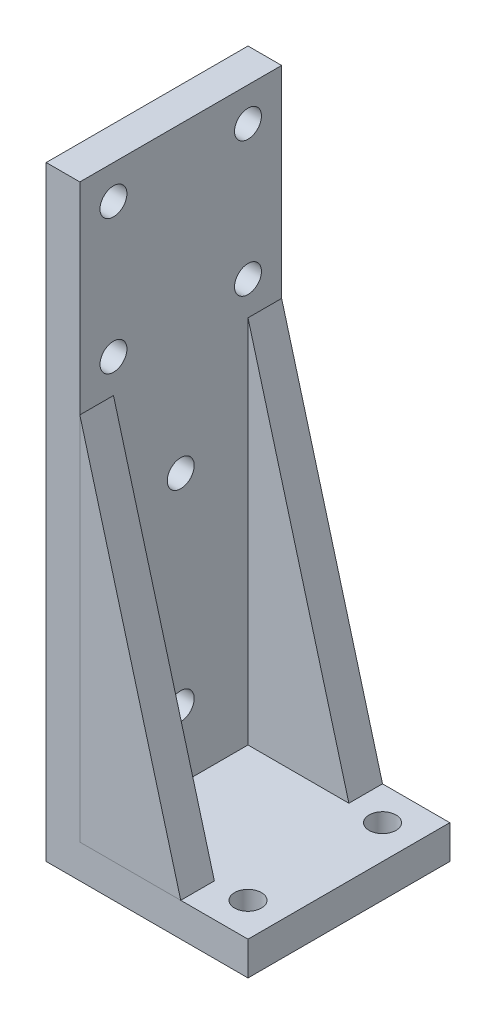
ISO-10303-21;
HEADER;
FILE_DESCRIPTION(('STEP AP214'),'2;1');
FILE_NAME('part.step','',(''),(''),'','','');
FILE_SCHEMA(('AUTOMOTIVE_DESIGN { 1 0 10303 214 1 1 1 1 }'));
ENDSEC;
DATA;
#1=APPLICATION_CONTEXT('core data for automotive mechanical design processes');
#2=APPLICATION_PROTOCOL_DEFINITION('international standard','automotive_design',2000,#1);
#3=PRODUCT_CONTEXT('',#1,'mechanical');
#4=PRODUCT('Part','Part','',(#3));
#5=PRODUCT_RELATED_PRODUCT_CATEGORY('part','',(#4));
#6=PRODUCT_DEFINITION_FORMATION('','',#4);
#7=PRODUCT_DEFINITION_CONTEXT('part definition',#1,'design');
#8=PRODUCT_DEFINITION('design','',#6,#7);
#9=PRODUCT_DEFINITION_SHAPE('','',#8);
#10=(LENGTH_UNIT() NAMED_UNIT(*) SI_UNIT(.MILLI.,.METRE.));
#11=(NAMED_UNIT(*) PLANE_ANGLE_UNIT() SI_UNIT($,.RADIAN.));
#12=(NAMED_UNIT(*) SI_UNIT($,.STERADIAN.) SOLID_ANGLE_UNIT());
#13=UNCERTAINTY_MEASURE_WITH_UNIT(LENGTH_MEASURE(1.E-05),#10,'distance_accuracy_value','');
#14=(GEOMETRIC_REPRESENTATION_CONTEXT(3) GLOBAL_UNCERTAINTY_ASSIGNED_CONTEXT((#13)) GLOBAL_UNIT_ASSIGNED_CONTEXT((#10,
#11,#12)) REPRESENTATION_CONTEXT('',''));
#15=CARTESIAN_POINT('',(0.,0.,0.));
#16=DIRECTION('',(0.,0.,1.));
#17=DIRECTION('',(1.,0.,0.));
#18=AXIS2_PLACEMENT_3D('',#15,#16,#17);
#19=CARTESIAN_POINT('',(5.00000000000001,5.,10.));
#20=DIRECTION('',(0.,-1.,0.));
#21=DIRECTION('',(0.,0.,-1.));
#22=AXIS2_PLACEMENT_3D('',#19,#20,#21);
#23=PLANE('',#22);
#24=DIRECTION('',(1.,0.,0.));
#25=VECTOR('',#24,1.);
#26=CARTESIAN_POINT('',(5.00000000000001,5.,15.));
#27=LINE('',#26,#25);
#28=CARTESIAN_POINT('',(-9.99999999999999,5.,15.));
#29=VERTEX_POINT('',#28);
#30=CARTESIAN_POINT('',(5.00000000000001,5.,15.));
#31=VERTEX_POINT('',#30);
#32=EDGE_CURVE('E96',#29,#31,#27,.T.);
#33=ORIENTED_EDGE('',*,*,#32,.F.);
#34=DIRECTION('',(0.,0.,1.));
#35=VECTOR('',#34,1.);
#36=CARTESIAN_POINT('',(-9.99999999999999,5.,10.));
#37=LINE('',#36,#35);
#38=CARTESIAN_POINT('',(-9.99999999999999,5.,10.));
#39=VERTEX_POINT('',#38);
#40=EDGE_CURVE('E12',#39,#29,#37,.T.);
#41=ORIENTED_EDGE('',*,*,#40,.F.);
#42=DIRECTION('',(1.,0.,0.));
#43=VECTOR('',#42,1.);
#44=CARTESIAN_POINT('',(5.00000000000001,5.,10.));
#45=LINE('',#44,#43);
#46=CARTESIAN_POINT('',(5.00000000000001,5.,10.));
#47=VERTEX_POINT('',#46);
#48=EDGE_CURVE('E88',#39,#47,#45,.T.);
#49=ORIENTED_EDGE('',*,*,#48,.T.);
#50=DIRECTION('',(0.,0.,1.));
#51=VECTOR('',#50,1.);
#52=CARTESIAN_POINT('',(5.00000000000001,5.,10.));
#53=LINE('',#52,#51);
#54=EDGE_CURVE('E47',#47,#31,#53,.T.);
#55=ORIENTED_EDGE('',*,*,#54,.T.);
#56=EDGE_LOOP('',(#33,#41,#49,#55));
#57=FACE_BOUND('',#56,.T.);
#58=ADVANCED_FACE('F44',(#57),#23,.T.);
#59=CARTESIAN_POINT('',(-9.99999999999999,5.,10.));
#60=DIRECTION('',(-1.,0.,0.));
#61=DIRECTION('',(0.,-1.,0.));
#62=AXIS2_PLACEMENT_3D('',#59,#60,#61);
#63=PLANE('',#62);
#64=DIRECTION('',(0.,-1.,0.));
#65=VECTOR('',#64,1.);
#66=CARTESIAN_POINT('',(-9.99999999999999,5.,15.));
#67=LINE('',#66,#65);
#68=CARTESIAN_POINT('',(-10.,60.,15.));
#69=VERTEX_POINT('',#68);
#70=EDGE_CURVE('E90',#69,#29,#67,.T.);
#71=ORIENTED_EDGE('',*,*,#70,.F.);
#72=DIRECTION('',(0.,0.,1.));
#73=VECTOR('',#72,1.);
#74=CARTESIAN_POINT('',(-10.,60.,10.));
#75=LINE('',#74,#73);
#76=CARTESIAN_POINT('',(-10.,60.,10.));
#77=VERTEX_POINT('',#76);
#78=EDGE_CURVE('E53',#77,#69,#75,.T.);
#79=ORIENTED_EDGE('',*,*,#78,.F.);
#80=DIRECTION('',(0.,-1.,0.));
#81=VECTOR('',#80,1.);
#82=CARTESIAN_POINT('',(-9.99999999999999,5.,10.));
#83=LINE('',#82,#81);
#84=EDGE_CURVE('E85',#77,#39,#83,.T.);
#85=ORIENTED_EDGE('',*,*,#84,.T.);
#86=ORIENTED_EDGE('',*,*,#40,.T.);
#87=EDGE_LOOP('',(#71,#79,#85,#86));
#88=FACE_BOUND('',#87,.T.);
#89=ADVANCED_FACE('F100',(#88),#63,.T.);
#90=CARTESIAN_POINT('',(-10.,60.,10.));
#91=DIRECTION('',(0.964763821237732,0.263117405792109,0.));
#92=DIRECTION('',(-0.263117405792109,0.964763821237732,0.));
#93=AXIS2_PLACEMENT_3D('',#90,#91,#92);
#94=PLANE('',#93);
#95=DIRECTION('',(-0.263117405792109,0.964763821237732,0.));
#96=VECTOR('',#95,1.);
#97=CARTESIAN_POINT('',(-10.,60.,15.));
#98=LINE('',#97,#96);
#99=EDGE_CURVE('E83',#31,#69,#98,.T.);
#100=ORIENTED_EDGE('',*,*,#99,.F.);
#101=ORIENTED_EDGE('',*,*,#54,.F.);
#102=DIRECTION('',(-0.263117405792109,0.964763821237732,0.));
#103=VECTOR('',#102,1.);
#104=CARTESIAN_POINT('',(-10.,60.,10.));
#105=LINE('',#104,#103);
#106=EDGE_CURVE('E81',#47,#77,#105,.T.);
#107=ORIENTED_EDGE('',*,*,#106,.T.);
#108=ORIENTED_EDGE('',*,*,#78,.T.);
#109=EDGE_LOOP('',(#100,#101,#107,#108));
#110=FACE_BOUND('',#109,.T.);
#111=ADVANCED_FACE('F80',(#110),#94,.T.);
#112=CARTESIAN_POINT('',(0.,0.,10.));
#113=DIRECTION('',(0.,0.,-1.));
#114=DIRECTION('',(-1.,0.,0.));
#115=AXIS2_PLACEMENT_3D('',#112,#113,#114);
#116=PLANE('',#115);
#117=ORIENTED_EDGE('',*,*,#48,.F.);
#118=ORIENTED_EDGE('',*,*,#84,.F.);
#119=ORIENTED_EDGE('',*,*,#106,.F.);
#120=EDGE_LOOP('',(#117,#118,#119));
#121=FACE_BOUND('',#120,.T.);
#122=ADVANCED_FACE('F87',(#121),#116,.T.);
#123=CARTESIAN_POINT('',(0.,0.,15.));
#124=DIRECTION('',(0.,0.,-1.));
#125=DIRECTION('',(-1.,0.,0.));
#126=AXIS2_PLACEMENT_3D('',#123,#124,#125);
#127=PLANE('',#126);
#128=ORIENTED_EDGE('',*,*,#32,.T.);
#129=ORIENTED_EDGE('',*,*,#99,.T.);
#130=ORIENTED_EDGE('',*,*,#70,.T.);
#131=EDGE_LOOP('',(#128,#129,#130));
#132=FACE_BOUND('',#131,.T.);
#133=ADVANCED_FACE('F99',(#132),#127,.F.);
#134=CLOSED_SHELL('',(#58,#89,#111,#122,#133));
#135=MANIFOLD_SOLID_BREP('B2',#134);
#136=CARTESIAN_POINT('',(0.,5.,0.));
#137=DIRECTION('',(0.,-1.,0.));
#138=DIRECTION('',(0.,0.,-1.));
#139=AXIS2_PLACEMENT_3D('',#136,#137,#138);
#140=PLANE('',#139);
#141=CARTESIAN_POINT('',(10.,5.,10.));
#142=DIRECTION('',(0.,1.,0.));
#143=DIRECTION('',(0.,0.,1.));
#144=AXIS2_PLACEMENT_3D('',#141,#142,#143);
#145=CIRCLE('',#144,2.);
#146=CARTESIAN_POINT('',(10.,5.,12.));
#147=VERTEX_POINT('',#146);
#148=EDGE_CURVE('E320',#147,#147,#145,.T.);
#149=ORIENTED_EDGE('',*,*,#148,.F.);
#150=EDGE_LOOP('',(#149));
#151=FACE_BOUND('',#150,.T.);
#152=CARTESIAN_POINT('',(10.,5.,-10.));
#153=DIRECTION('',(0.,1.,0.));
#154=DIRECTION('',(0.,0.,1.));
#155=AXIS2_PLACEMENT_3D('',#152,#153,#154);
#156=CIRCLE('',#155,2.);
#157=CARTESIAN_POINT('',(10.,5.,-8.));
#158=VERTEX_POINT('',#157);
#159=EDGE_CURVE('E314',#158,#158,#156,.T.);
#160=ORIENTED_EDGE('',*,*,#159,.F.);
#161=EDGE_LOOP('',(#160));
#162=FACE_BOUND('',#161,.T.);
#163=DIRECTION('',(0.,0.,-1.));
#164=VECTOR('',#163,1.);
#165=CARTESIAN_POINT('',(5.00000000000001,5.,-10.));
#166=LINE('',#165,#164);
#167=CARTESIAN_POINT('',(5.00000000000001,5.,-10.));
#168=VERTEX_POINT('',#167);
#169=CARTESIAN_POINT('',(5.00000000000001,5.,-15.));
#170=VERTEX_POINT('',#169);
#171=EDGE_CURVE('E241',#168,#170,#166,.T.);
#172=ORIENTED_EDGE('',*,*,#171,.F.);
#173=DIRECTION('',(1.,0.,0.));
#174=VECTOR('',#173,1.);
#175=CARTESIAN_POINT('',(5.00000000000001,5.,-10.));
#176=LINE('',#175,#174);
#177=CARTESIAN_POINT('',(-9.99999999999999,5.,-10.));
#178=VERTEX_POINT('',#177);
#179=EDGE_CURVE('E256',#178,#168,#176,.T.);
#180=ORIENTED_EDGE('',*,*,#179,.F.);
#181=DIRECTION('',(0.,0.,-1.));
#182=VECTOR('',#181,1.);
#183=CARTESIAN_POINT('',(-9.99999999999999,5.,-15.));
#184=LINE('',#183,#182);
#185=CARTESIAN_POINT('',(-9.99999999999999,5.,15.));
#186=VERTEX_POINT('',#185);
#187=EDGE_CURVE('E156',#186,#178,#184,.T.);
#188=ORIENTED_EDGE('',*,*,#187,.F.);
#189=DIRECTION('',(1.,0.,0.));
#190=VECTOR('',#189,1.);
#191=CARTESIAN_POINT('',(-15.,5.,15.));
#192=LINE('',#191,#190);
#193=CARTESIAN_POINT('',(15.,5.,15.));
#194=VERTEX_POINT('',#193);
#195=EDGE_CURVE('E161',#186,#194,#192,.T.);
#196=ORIENTED_EDGE('',*,*,#195,.T.);
#197=DIRECTION('',(0.,0.,-1.));
#198=VECTOR('',#197,1.);
#199=CARTESIAN_POINT('',(15.,5.,15.));
#200=LINE('',#199,#198);
#201=CARTESIAN_POINT('',(15.,5.,-15.));
#202=VERTEX_POINT('',#201);
#203=EDGE_CURVE('E192',#194,#202,#200,.T.);
#204=ORIENTED_EDGE('',*,*,#203,.T.);
#205=DIRECTION('',(-1.,0.,0.));
#206=VECTOR('',#205,1.);
#207=CARTESIAN_POINT('',(-15.,5.,-15.));
#208=LINE('',#207,#206);
#209=EDGE_CURVE('E243',#202,#170,#208,.T.);
#210=ORIENTED_EDGE('',*,*,#209,.T.);
#211=EDGE_LOOP('',(#172,#180,#188,#196,#204,#210));
#212=FACE_BOUND('',#211,.T.);
#213=ADVANCED_FACE('F141',(#151,#162,#212),#140,.F.);
#214=CARTESIAN_POINT('',(-9.99999999999999,90.,-15.));
#215=DIRECTION('',(-1.,0.,0.));
#216=DIRECTION('',(0.,0.,1.));
#217=AXIS2_PLACEMENT_3D('',#214,#215,#216);
#218=PLANE('',#217);
#219=CARTESIAN_POINT('',(-9.99999999999999,65.,-10.));
#220=DIRECTION('',(1.,0.,0.));
#221=DIRECTION('',(0.,0.,-1.));
#222=AXIS2_PLACEMENT_3D('',#219,#220,#221);
#223=CIRCLE('',#222,2.);
#224=CARTESIAN_POINT('',(-9.99999999999999,65.,-12.));
#225=VERTEX_POINT('',#224);
#226=EDGE_CURVE('E332',#225,#225,#223,.T.);
#227=ORIENTED_EDGE('',*,*,#226,.F.);
#228=EDGE_LOOP('',(#227));
#229=FACE_BOUND('',#228,.T.);
#230=CARTESIAN_POINT('',(-9.99999999999999,65.,10.));
#231=DIRECTION('',(1.,0.,0.));
#232=DIRECTION('',(0.,0.,-1.));
#233=AXIS2_PLACEMENT_3D('',#230,#231,#232);
#234=CIRCLE('',#233,2.);
#235=CARTESIAN_POINT('',(-9.99999999999999,65.,8.));
#236=VERTEX_POINT('',#235);
#237=EDGE_CURVE('E326',#236,#236,#234,.T.);
#238=ORIENTED_EDGE('',*,*,#237,.F.);
#239=EDGE_LOOP('',(#238));
#240=FACE_BOUND('',#239,.T.);
#241=CARTESIAN_POINT('',(-9.99999999999999,85.,-10.));
#242=DIRECTION('',(1.,0.,0.));
#243=DIRECTION('',(0.,0.,-1.));
#244=AXIS2_PLACEMENT_3D('',#241,#242,#243);
#245=CIRCLE('',#244,2.);
#246=CARTESIAN_POINT('',(-9.99999999999999,85.,-12.));
#247=VERTEX_POINT('',#246);
#248=EDGE_CURVE('E309',#247,#247,#245,.T.);
#249=ORIENTED_EDGE('',*,*,#248,.F.);
#250=EDGE_LOOP('',(#249));
#251=FACE_BOUND('',#250,.T.);
#252=CARTESIAN_POINT('',(-9.99999999999999,15.,0.));
#253=DIRECTION('',(1.,0.,0.));
#254=DIRECTION('',(0.,0.,-1.));
#255=AXIS2_PLACEMENT_3D('',#252,#253,#254);
#256=CIRCLE('',#255,2.);
#257=CARTESIAN_POINT('',(-9.99999999999999,15.,-2.));
#258=VERTEX_POINT('',#257);
#259=EDGE_CURVE('E303',#258,#258,#256,.T.);
#260=ORIENTED_EDGE('',*,*,#259,.F.);
#261=EDGE_LOOP('',(#260));
#262=FACE_BOUND('',#261,.T.);
#263=CARTESIAN_POINT('',(-9.99999999999999,45.,0.));
#264=DIRECTION('',(1.,0.,0.));
#265=DIRECTION('',(0.,0.,-1.));
#266=AXIS2_PLACEMENT_3D('',#263,#264,#265);
#267=CIRCLE('',#266,2.);
#268=CARTESIAN_POINT('',(-9.99999999999999,45.,-2.));
#269=VERTEX_POINT('',#268);
#270=EDGE_CURVE('E296',#269,#269,#267,.T.);
#271=ORIENTED_EDGE('',*,*,#270,.F.);
#272=EDGE_LOOP('',(#271));
#273=FACE_BOUND('',#272,.T.);
#274=CARTESIAN_POINT('',(-9.99999999999999,85.,10.));
#275=DIRECTION('',(1.,0.,0.));
#276=DIRECTION('',(0.,0.,-1.));
#277=AXIS2_PLACEMENT_3D('',#274,#275,#276);
#278=CIRCLE('',#277,2.);
#279=CARTESIAN_POINT('',(-9.99999999999999,85.,8.));
#280=VERTEX_POINT('',#279);
#281=EDGE_CURVE('E290',#280,#280,#278,.T.);
#282=ORIENTED_EDGE('',*,*,#281,.F.);
#283=EDGE_LOOP('',(#282));
#284=FACE_BOUND('',#283,.T.);
#285=DIRECTION('',(0.,0.,-1.));
#286=VECTOR('',#285,1.);
#287=CARTESIAN_POINT('',(-9.99999999999999,60.,-10.));
#288=LINE('',#287,#286);
#289=CARTESIAN_POINT('',(-9.99999999999999,60.,-10.));
#290=VERTEX_POINT('',#289);
#291=CARTESIAN_POINT('',(-9.99999999999999,60.,-15.));
#292=VERTEX_POINT('',#291);
#293=EDGE_CURVE('E264',#290,#292,#288,.T.);
#294=ORIENTED_EDGE('',*,*,#293,.T.);
#295=DIRECTION('',(0.,-1.,0.));
#296=VECTOR('',#295,1.);
#297=CARTESIAN_POINT('',(-9.99999999999999,90.,-15.));
#298=LINE('',#297,#296);
#299=CARTESIAN_POINT('',(-9.99999999999999,90.,-15.));
#300=VERTEX_POINT('',#299);
#301=EDGE_CURVE('E206',#300,#292,#298,.T.);
#302=ORIENTED_EDGE('',*,*,#301,.F.);
#303=DIRECTION('',(0.,0.,-1.));
#304=VECTOR('',#303,1.);
#305=CARTESIAN_POINT('',(-9.99999999999999,90.,-15.));
#306=LINE('',#305,#304);
#307=CARTESIAN_POINT('',(-9.99999999999999,90.,15.));
#308=VERTEX_POINT('',#307);
#309=EDGE_CURVE('E233',#308,#300,#306,.T.);
#310=ORIENTED_EDGE('',*,*,#309,.F.);
#311=DIRECTION('',(0.,-1.,0.));
#312=VECTOR('',#311,1.);
#313=CARTESIAN_POINT('',(-9.99999999999999,90.,15.));
#314=LINE('',#313,#312);
#315=EDGE_CURVE('E202',#308,#186,#314,.T.);
#316=ORIENTED_EDGE('',*,*,#315,.T.);
#317=ORIENTED_EDGE('',*,*,#187,.T.);
#318=DIRECTION('',(0.,-1.,0.));
#319=VECTOR('',#318,1.);
#320=CARTESIAN_POINT('',(-9.99999999999999,5.,-10.));
#321=LINE('',#320,#319);
#322=EDGE_CURVE('E266',#290,#178,#321,.T.);
#323=ORIENTED_EDGE('',*,*,#322,.F.);
#324=EDGE_LOOP('',(#294,#302,#310,#316,#317,#323));
#325=FACE_BOUND('',#324,.T.);
#326=ADVANCED_FACE('F273',(#229,#240,#251,#262,#273,#284,#325),#218,.F.);
#327=CARTESIAN_POINT('',(15.,5.,15.));
#328=DIRECTION('',(-1.,0.,0.));
#329=DIRECTION('',(0.,0.,1.));
#330=AXIS2_PLACEMENT_3D('',#327,#328,#329);
#331=PLANE('',#330);
#332=DIRECTION('',(0.,0.,-1.));
#333=VECTOR('',#332,1.);
#334=CARTESIAN_POINT('',(15.,0.,15.));
#335=LINE('',#334,#333);
#336=CARTESIAN_POINT('',(15.,0.,15.));
#337=VERTEX_POINT('',#336);
#338=CARTESIAN_POINT('',(15.,0.,-15.));
#339=VERTEX_POINT('',#338);
#340=EDGE_CURVE('E198',#337,#339,#335,.T.);
#341=ORIENTED_EDGE('',*,*,#340,.T.);
#342=DIRECTION('',(0.,-1.,0.));
#343=VECTOR('',#342,1.);
#344=CARTESIAN_POINT('',(15.,5.,-15.));
#345=LINE('',#344,#343);
#346=EDGE_CURVE('E42',#202,#339,#345,.T.);
#347=ORIENTED_EDGE('',*,*,#346,.F.);
#348=ORIENTED_EDGE('',*,*,#203,.F.);
#349=DIRECTION('',(0.,-1.,0.));
#350=VECTOR('',#349,1.);
#351=CARTESIAN_POINT('',(15.,5.,15.));
#352=LINE('',#351,#350);
#353=EDGE_CURVE('E184',#194,#337,#352,.T.);
#354=ORIENTED_EDGE('',*,*,#353,.T.);
#355=EDGE_LOOP('',(#341,#347,#348,#354));
#356=FACE_BOUND('',#355,.T.);
#357=ADVANCED_FACE('F143',(#356),#331,.F.);
#358=CARTESIAN_POINT('',(-15.,5.,-15.));
#359=DIRECTION('',(0.,0.,1.));
#360=DIRECTION('',(1.,0.,0.));
#361=AXIS2_PLACEMENT_3D('',#358,#359,#360);
#362=PLANE('',#361);
#363=DIRECTION('',(-0.263117405792109,0.964763821237732,0.));
#364=VECTOR('',#363,1.);
#365=CARTESIAN_POINT('',(-9.99999999999999,60.,-15.));
#366=LINE('',#365,#364);
#367=EDGE_CURVE('E252',#170,#292,#366,.T.);
#368=ORIENTED_EDGE('',*,*,#367,.F.);
#369=ORIENTED_EDGE('',*,*,#209,.F.);
#370=ORIENTED_EDGE('',*,*,#346,.T.);
#371=DIRECTION('',(-1.,0.,0.));
#372=VECTOR('',#371,1.);
#373=CARTESIAN_POINT('',(-15.,0.,-15.));
#374=LINE('',#373,#372);
#375=CARTESIAN_POINT('',(-15.,0.,-15.));
#376=VERTEX_POINT('',#375);
#377=EDGE_CURVE('E201',#339,#376,#374,.T.);
#378=ORIENTED_EDGE('',*,*,#377,.T.);
#379=DIRECTION('',(0.,-1.,0.));
#380=VECTOR('',#379,1.);
#381=CARTESIAN_POINT('',(-15.,5.,-15.));
#382=LINE('',#381,#380);
#383=CARTESIAN_POINT('',(-15.,90.,-15.));
#384=VERTEX_POINT('',#383);
#385=EDGE_CURVE('E149',#384,#376,#382,.T.);
#386=ORIENTED_EDGE('',*,*,#385,.F.);
#387=DIRECTION('',(-1.,0.,0.));
#388=VECTOR('',#387,1.);
#389=CARTESIAN_POINT('',(-15.,90.,-15.));
#390=LINE('',#389,#388);
#391=EDGE_CURVE('E226',#300,#384,#390,.T.);
#392=ORIENTED_EDGE('',*,*,#391,.F.);
#393=ORIENTED_EDGE('',*,*,#301,.T.);
#394=EDGE_LOOP('',(#368,#369,#370,#378,#386,#392,#393));
#395=FACE_BOUND('',#394,.T.);
#396=ADVANCED_FACE('F223',(#395),#362,.F.);
#397=CARTESIAN_POINT('',(-15.,5.,15.));
#398=DIRECTION('',(1.,0.,0.));
#399=DIRECTION('',(0.,0.,-1.));
#400=AXIS2_PLACEMENT_3D('',#397,#398,#399);
#401=PLANE('',#400);
#402=CARTESIAN_POINT('',(-15.,65.,-10.));
#403=DIRECTION('',(1.,0.,0.));
#404=DIRECTION('',(0.,0.,-1.));
#405=AXIS2_PLACEMENT_3D('',#402,#403,#404);
#406=CIRCLE('',#405,2.);
#407=CARTESIAN_POINT('',(-15.,65.,-12.));
#408=VERTEX_POINT('',#407);
#409=EDGE_CURVE('E329',#408,#408,#406,.T.);
#410=ORIENTED_EDGE('',*,*,#409,.T.);
#411=EDGE_LOOP('',(#410));
#412=FACE_BOUND('',#411,.T.);
#413=CARTESIAN_POINT('',(-15.,65.,10.));
#414=DIRECTION('',(1.,0.,0.));
#415=DIRECTION('',(0.,0.,-1.));
#416=AXIS2_PLACEMENT_3D('',#413,#414,#415);
#417=CIRCLE('',#416,2.);
#418=CARTESIAN_POINT('',(-15.,65.,8.));
#419=VERTEX_POINT('',#418);
#420=EDGE_CURVE('E323',#419,#419,#417,.T.);
#421=ORIENTED_EDGE('',*,*,#420,.T.);
#422=EDGE_LOOP('',(#421));
#423=FACE_BOUND('',#422,.T.);
#424=CARTESIAN_POINT('',(-15.,85.,-10.));
#425=DIRECTION('',(1.,0.,0.));
#426=DIRECTION('',(0.,0.,-1.));
#427=AXIS2_PLACEMENT_3D('',#424,#425,#426);
#428=CIRCLE('',#427,2.);
#429=CARTESIAN_POINT('',(-15.,85.,-12.));
#430=VERTEX_POINT('',#429);
#431=EDGE_CURVE('E293',#430,#430,#428,.T.);
#432=ORIENTED_EDGE('',*,*,#431,.T.);
#433=EDGE_LOOP('',(#432));
#434=FACE_BOUND('',#433,.T.);
#435=CARTESIAN_POINT('',(-15.,15.,0.));
#436=DIRECTION('',(1.,0.,0.));
#437=DIRECTION('',(0.,0.,-1.));
#438=AXIS2_PLACEMENT_3D('',#435,#436,#437);
#439=CIRCLE('',#438,2.);
#440=CARTESIAN_POINT('',(-15.,15.,-2.));
#441=VERTEX_POINT('',#440);
#442=EDGE_CURVE('E306',#441,#441,#439,.T.);
#443=ORIENTED_EDGE('',*,*,#442,.T.);
#444=EDGE_LOOP('',(#443));
#445=FACE_BOUND('',#444,.T.);
#446=CARTESIAN_POINT('',(-15.,45.,0.));
#447=DIRECTION('',(1.,0.,0.));
#448=DIRECTION('',(0.,0.,-1.));
#449=AXIS2_PLACEMENT_3D('',#446,#447,#448);
#450=CIRCLE('',#449,2.);
#451=CARTESIAN_POINT('',(-15.,45.,-2.));
#452=VERTEX_POINT('',#451);
#453=EDGE_CURVE('E299',#452,#452,#450,.T.);
#454=ORIENTED_EDGE('',*,*,#453,.T.);
#455=EDGE_LOOP('',(#454));
#456=FACE_BOUND('',#455,.T.);
#457=CARTESIAN_POINT('',(-15.,85.,10.));
#458=DIRECTION('',(1.,0.,0.));
#459=DIRECTION('',(0.,0.,-1.));
#460=AXIS2_PLACEMENT_3D('',#457,#458,#459);
#461=CIRCLE('',#460,2.);
#462=CARTESIAN_POINT('',(-15.,85.,8.));
#463=VERTEX_POINT('',#462);
#464=EDGE_CURVE('E257',#463,#463,#461,.T.);
#465=ORIENTED_EDGE('',*,*,#464,.T.);
#466=EDGE_LOOP('',(#465));
#467=FACE_BOUND('',#466,.T.);
#468=DIRECTION('',(0.,0.,1.));
#469=VECTOR('',#468,1.);
#470=CARTESIAN_POINT('',(-15.,0.,15.));
#471=LINE('',#470,#469);
#472=CARTESIAN_POINT('',(-15.,0.,15.));
#473=VERTEX_POINT('',#472);
#474=EDGE_CURVE('E193',#376,#473,#471,.T.);
#475=ORIENTED_EDGE('',*,*,#474,.T.);
#476=DIRECTION('',(0.,-1.,0.));
#477=VECTOR('',#476,1.);
#478=CARTESIAN_POINT('',(-15.,5.,15.));
#479=LINE('',#478,#477);
#480=CARTESIAN_POINT('',(-15.,90.,15.));
#481=VERTEX_POINT('',#480);
#482=EDGE_CURVE('E188',#481,#473,#479,.T.);
#483=ORIENTED_EDGE('',*,*,#482,.F.);
#484=DIRECTION('',(0.,0.,1.));
#485=VECTOR('',#484,1.);
#486=CARTESIAN_POINT('',(-15.,90.,-15.));
#487=LINE('',#486,#485);
#488=EDGE_CURVE('E218',#384,#481,#487,.T.);
#489=ORIENTED_EDGE('',*,*,#488,.F.);
#490=ORIENTED_EDGE('',*,*,#385,.T.);
#491=EDGE_LOOP('',(#475,#483,#489,#490));
#492=FACE_BOUND('',#491,.T.);
#493=ADVANCED_FACE('F216',(#412,#423,#434,#445,#456,#467,#492),#401,.F.);
#494=CARTESIAN_POINT('',(-15.,5.,15.));
#495=DIRECTION('',(0.,0.,-1.));
#496=DIRECTION('',(-1.,0.,0.));
#497=AXIS2_PLACEMENT_3D('',#494,#495,#496);
#498=PLANE('',#497);
#499=DIRECTION('',(1.,0.,0.));
#500=VECTOR('',#499,1.);
#501=CARTESIAN_POINT('',(-15.,0.,15.));
#502=LINE('',#501,#500);
#503=EDGE_CURVE('E181',#473,#337,#502,.T.);
#504=ORIENTED_EDGE('',*,*,#503,.T.);
#505=ORIENTED_EDGE('',*,*,#353,.F.);
#506=ORIENTED_EDGE('',*,*,#195,.F.);
#507=ORIENTED_EDGE('',*,*,#315,.F.);
#508=DIRECTION('',(1.,0.,0.));
#509=VECTOR('',#508,1.);
#510=CARTESIAN_POINT('',(-15.,90.,15.));
#511=LINE('',#510,#509);
#512=EDGE_CURVE('E237',#481,#308,#511,.T.);
#513=ORIENTED_EDGE('',*,*,#512,.F.);
#514=ORIENTED_EDGE('',*,*,#482,.T.);
#515=EDGE_LOOP('',(#504,#505,#506,#507,#513,#514));
#516=FACE_BOUND('',#515,.T.);
#517=ADVANCED_FACE('F183',(#516),#498,.F.);
#518=CARTESIAN_POINT('',(0.,0.,0.));
#519=DIRECTION('',(0.,-1.,0.));
#520=DIRECTION('',(0.,0.,-1.));
#521=AXIS2_PLACEMENT_3D('',#518,#519,#520);
#522=PLANE('',#521);
#523=CARTESIAN_POINT('',(10.,0.,10.));
#524=DIRECTION('',(0.,1.,0.));
#525=DIRECTION('',(0.,0.,1.));
#526=AXIS2_PLACEMENT_3D('',#523,#524,#525);
#527=CIRCLE('',#526,2.);
#528=CARTESIAN_POINT('',(10.,0.,12.));
#529=VERTEX_POINT('',#528);
#530=EDGE_CURVE('E317',#529,#529,#527,.T.);
#531=ORIENTED_EDGE('',*,*,#530,.T.);
#532=EDGE_LOOP('',(#531));
#533=FACE_BOUND('',#532,.T.);
#534=CARTESIAN_POINT('',(10.,0.,-10.));
#535=DIRECTION('',(0.,1.,0.));
#536=DIRECTION('',(0.,0.,1.));
#537=AXIS2_PLACEMENT_3D('',#534,#535,#536);
#538=CIRCLE('',#537,2.);
#539=CARTESIAN_POINT('',(10.,0.,-8.));
#540=VERTEX_POINT('',#539);
#541=EDGE_CURVE('E300',#540,#540,#538,.T.);
#542=ORIENTED_EDGE('',*,*,#541,.T.);
#543=EDGE_LOOP('',(#542));
#544=FACE_BOUND('',#543,.T.);
#545=ORIENTED_EDGE('',*,*,#340,.F.);
#546=ORIENTED_EDGE('',*,*,#503,.F.);
#547=ORIENTED_EDGE('',*,*,#474,.F.);
#548=ORIENTED_EDGE('',*,*,#377,.F.);
#549=EDGE_LOOP('',(#545,#546,#547,#548));
#550=FACE_BOUND('',#549,.T.);
#551=ADVANCED_FACE('F200',(#533,#544,#550),#522,.T.);
#552=CARTESIAN_POINT('',(0.,90.,0.));
#553=DIRECTION('',(0.,1.,0.));
#554=DIRECTION('',(0.,0.,1.));
#555=AXIS2_PLACEMENT_3D('',#552,#553,#554);
#556=PLANE('',#555);
#557=ORIENTED_EDGE('',*,*,#488,.T.);
#558=ORIENTED_EDGE('',*,*,#512,.T.);
#559=ORIENTED_EDGE('',*,*,#309,.T.);
#560=ORIENTED_EDGE('',*,*,#391,.T.);
#561=EDGE_LOOP('',(#557,#558,#559,#560));
#562=FACE_BOUND('',#561,.T.);
#563=ADVANCED_FACE('F229',(#562),#556,.T.);
#564=CARTESIAN_POINT('',(-9.99999999999999,60.,-10.));
#565=DIRECTION('',(-0.964763821237732,-0.263117405792109,0.));
#566=DIRECTION('',(0.263117405792109,-0.964763821237732,0.));
#567=AXIS2_PLACEMENT_3D('',#564,#565,#566);
#568=PLANE('',#567);
#569=ORIENTED_EDGE('',*,*,#367,.T.);
#570=ORIENTED_EDGE('',*,*,#293,.F.);
#571=DIRECTION('',(-0.263117405792109,0.964763821237732,0.));
#572=VECTOR('',#571,1.);
#573=CARTESIAN_POINT('',(-9.99999999999999,60.,-10.));
#574=LINE('',#573,#572);
#575=EDGE_CURVE('E262',#168,#290,#574,.T.);
#576=ORIENTED_EDGE('',*,*,#575,.F.);
#577=ORIENTED_EDGE('',*,*,#171,.T.);
#578=EDGE_LOOP('',(#569,#570,#576,#577));
#579=FACE_BOUND('',#578,.T.);
#580=ADVANCED_FACE('F260',(#579),#568,.F.);
#581=CARTESIAN_POINT('',(0.,0.,-10.));
#582=DIRECTION('',(0.,0.,-1.));
#583=DIRECTION('',(-1.,0.,0.));
#584=AXIS2_PLACEMENT_3D('',#581,#582,#583);
#585=PLANE('',#584);
#586=ORIENTED_EDGE('',*,*,#179,.T.);
#587=ORIENTED_EDGE('',*,*,#575,.T.);
#588=ORIENTED_EDGE('',*,*,#322,.T.);
#589=EDGE_LOOP('',(#586,#587,#588));
#590=FACE_BOUND('',#589,.T.);
#591=ADVANCED_FACE('F285',(#590),#585,.F.);
#592=CARTESIAN_POINT('',(-15.,85.,10.));
#593=DIRECTION('',(1.,0.,0.));
#594=DIRECTION('',(0.,0.,-1.));
#595=AXIS2_PLACEMENT_3D('',#592,#593,#594);
#596=CYLINDRICAL_SURFACE('',#595,2.);
#597=ORIENTED_EDGE('',*,*,#464,.F.);
#598=EDGE_LOOP('',(#597));
#599=FACE_BOUND('',#598,.T.);
#600=ORIENTED_EDGE('',*,*,#281,.T.);
#601=EDGE_LOOP('',(#600));
#602=FACE_BOUND('',#601,.T.);
#603=ADVANCED_FACE('F360',(#599,#602),#596,.F.);
#604=CARTESIAN_POINT('',(-15.,45.,0.));
#605=DIRECTION('',(1.,0.,0.));
#606=DIRECTION('',(0.,0.,-1.));
#607=AXIS2_PLACEMENT_3D('',#604,#605,#606);
#608=CYLINDRICAL_SURFACE('',#607,2.);
#609=ORIENTED_EDGE('',*,*,#453,.F.);
#610=EDGE_LOOP('',(#609));
#611=FACE_BOUND('',#610,.T.);
#612=ORIENTED_EDGE('',*,*,#270,.T.);
#613=EDGE_LOOP('',(#612));
#614=FACE_BOUND('',#613,.T.);
#615=ADVANCED_FACE('F362',(#611,#614),#608,.F.);
#616=CARTESIAN_POINT('',(-15.,15.,0.));
#617=DIRECTION('',(1.,0.,0.));
#618=DIRECTION('',(0.,0.,-1.));
#619=AXIS2_PLACEMENT_3D('',#616,#617,#618);
#620=CYLINDRICAL_SURFACE('',#619,2.);
#621=ORIENTED_EDGE('',*,*,#442,.F.);
#622=EDGE_LOOP('',(#621));
#623=FACE_BOUND('',#622,.T.);
#624=ORIENTED_EDGE('',*,*,#259,.T.);
#625=EDGE_LOOP('',(#624));
#626=FACE_BOUND('',#625,.T.);
#627=ADVANCED_FACE('F369',(#623,#626),#620,.F.);
#628=CARTESIAN_POINT('',(-15.,85.,-10.));
#629=DIRECTION('',(1.,0.,0.));
#630=DIRECTION('',(0.,0.,-1.));
#631=AXIS2_PLACEMENT_3D('',#628,#629,#630);
#632=CYLINDRICAL_SURFACE('',#631,2.);
#633=ORIENTED_EDGE('',*,*,#431,.F.);
#634=EDGE_LOOP('',(#633));
#635=FACE_BOUND('',#634,.T.);
#636=ORIENTED_EDGE('',*,*,#248,.T.);
#637=EDGE_LOOP('',(#636));
#638=FACE_BOUND('',#637,.T.);
#639=ADVANCED_FACE('F443',(#635,#638),#632,.F.);
#640=CARTESIAN_POINT('',(10.,0.,-10.));
#641=DIRECTION('',(0.,1.,0.));
#642=DIRECTION('',(0.,0.,1.));
#643=AXIS2_PLACEMENT_3D('',#640,#641,#642);
#644=CYLINDRICAL_SURFACE('',#643,2.);
#645=ORIENTED_EDGE('',*,*,#541,.F.);
#646=EDGE_LOOP('',(#645));
#647=FACE_BOUND('',#646,.T.);
#648=ORIENTED_EDGE('',*,*,#159,.T.);
#649=EDGE_LOOP('',(#648));
#650=FACE_BOUND('',#649,.T.);
#651=ADVANCED_FACE('F438',(#647,#650),#644,.F.);
#652=CARTESIAN_POINT('',(10.,0.,10.));
#653=DIRECTION('',(0.,1.,0.));
#654=DIRECTION('',(0.,0.,1.));
#655=AXIS2_PLACEMENT_3D('',#652,#653,#654);
#656=CYLINDRICAL_SURFACE('',#655,2.);
#657=ORIENTED_EDGE('',*,*,#530,.F.);
#658=EDGE_LOOP('',(#657));
#659=FACE_BOUND('',#658,.T.);
#660=ORIENTED_EDGE('',*,*,#148,.T.);
#661=EDGE_LOOP('',(#660));
#662=FACE_BOUND('',#661,.T.);
#663=ADVANCED_FACE('F408',(#659,#662),#656,.F.);
#664=CARTESIAN_POINT('',(-15.,65.,10.));
#665=DIRECTION('',(1.,0.,0.));
#666=DIRECTION('',(0.,0.,-1.));
#667=AXIS2_PLACEMENT_3D('',#664,#665,#666);
#668=CYLINDRICAL_SURFACE('',#667,2.);
#669=ORIENTED_EDGE('',*,*,#420,.F.);
#670=EDGE_LOOP('',(#669));
#671=FACE_BOUND('',#670,.T.);
#672=ORIENTED_EDGE('',*,*,#237,.T.);
#673=EDGE_LOOP('',(#672));
#674=FACE_BOUND('',#673,.T.);
#675=ADVANCED_FACE('F343',(#671,#674),#668,.F.);
#676=CARTESIAN_POINT('',(-15.,65.,-10.));
#677=DIRECTION('',(1.,0.,0.));
#678=DIRECTION('',(0.,0.,-1.));
#679=AXIS2_PLACEMENT_3D('',#676,#677,#678);
#680=CYLINDRICAL_SURFACE('',#679,2.);
#681=ORIENTED_EDGE('',*,*,#409,.F.);
#682=EDGE_LOOP('',(#681));
#683=FACE_BOUND('',#682,.T.);
#684=ORIENTED_EDGE('',*,*,#226,.T.);
#685=EDGE_LOOP('',(#684));
#686=FACE_BOUND('',#685,.T.);
#687=ADVANCED_FACE('F340',(#683,#686),#680,.F.);
#688=CLOSED_SHELL('',(#213,#326,#357,#396,#493,#517,#551,#563,#580,#591,#603,#615,#627,#639,
#651,#663,#675,#687));
#689=MANIFOLD_SOLID_BREP('B6',#688);
#690=ADVANCED_BREP_SHAPE_REPRESENTATION('',(#18,#135,#689),#14);
#691=SHAPE_DEFINITION_REPRESENTATION(#9,#690);
ENDSEC;
END-ISO-10303-21;
